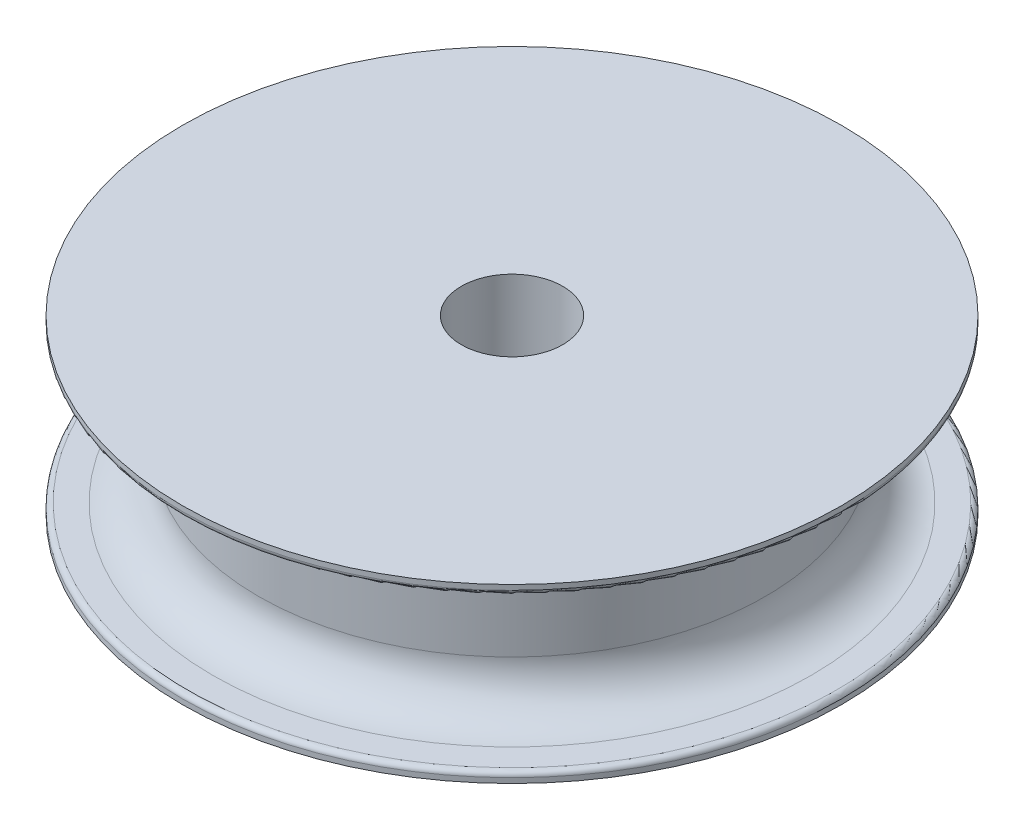
ISO-10303-21;
HEADER;
FILE_DESCRIPTION(('STEP AP214'),'2;1');
FILE_NAME('part.step','',(''),(''),'','','');
FILE_SCHEMA(('AUTOMOTIVE_DESIGN { 1 0 10303 214 1 1 1 1 }'));
ENDSEC;
DATA;
#1=APPLICATION_CONTEXT('core data for automotive mechanical design processes');
#2=APPLICATION_PROTOCOL_DEFINITION('international standard','automotive_design',2000,#1);
#3=PRODUCT_CONTEXT('',#1,'mechanical');
#4=PRODUCT('Part','Part','',(#3));
#5=PRODUCT_RELATED_PRODUCT_CATEGORY('part','',(#4));
#6=PRODUCT_DEFINITION_FORMATION('','',#4);
#7=PRODUCT_DEFINITION_CONTEXT('part definition',#1,'design');
#8=PRODUCT_DEFINITION('design','',#6,#7);
#9=PRODUCT_DEFINITION_SHAPE('','',#8);
#10=(LENGTH_UNIT() NAMED_UNIT(*) SI_UNIT(.MILLI.,.METRE.));
#11=(NAMED_UNIT(*) PLANE_ANGLE_UNIT() SI_UNIT($,.RADIAN.));
#12=(NAMED_UNIT(*) SI_UNIT($,.STERADIAN.) SOLID_ANGLE_UNIT());
#13=UNCERTAINTY_MEASURE_WITH_UNIT(LENGTH_MEASURE(1.E-05),#10,'distance_accuracy_value','');
#14=(GEOMETRIC_REPRESENTATION_CONTEXT(3) GLOBAL_UNCERTAINTY_ASSIGNED_CONTEXT((#13)) GLOBAL_UNIT_ASSIGNED_CONTEXT((#10,
#11,#12)) REPRESENTATION_CONTEXT('',''));
#15=CARTESIAN_POINT('',(0.,0.,0.));
#16=DIRECTION('',(0.,0.,1.));
#17=DIRECTION('',(1.,0.,0.));
#18=AXIS2_PLACEMENT_3D('',#15,#16,#17);
#19=CARTESIAN_POINT('',(0.,-15.,0.));
#20=DIRECTION('',(0.,1.,0.));
#21=DIRECTION('',(0.,0.,1.));
#22=AXIS2_PLACEMENT_3D('',#19,#20,#21);
#23=CYLINDRICAL_SURFACE('',#22,50.);
#24=CARTESIAN_POINT('',(0.,6.,0.));
#25=DIRECTION('',(0.,1.,0.));
#26=DIRECTION('',(0.,0.,1.));
#27=AXIS2_PLACEMENT_3D('',#24,#25,#26);
#28=CIRCLE('',#27,50.);
#29=CARTESIAN_POINT('',(0.,6.,50.));
#30=VERTEX_POINT('',#29);
#31=EDGE_CURVE('E10',#30,#30,#28,.F.);
#32=ORIENTED_EDGE('',*,*,#31,.T.);
#33=EDGE_LOOP('',(#32));
#34=FACE_BOUND('',#33,.T.);
#35=CARTESIAN_POINT('',(0.,-6.,0.));
#36=DIRECTION('',(0.,-1.,0.));
#37=DIRECTION('',(0.,0.,-1.));
#38=AXIS2_PLACEMENT_3D('',#35,#36,#37);
#39=CIRCLE('',#38,50.);
#40=CARTESIAN_POINT('',(0.,-6.,-50.));
#41=VERTEX_POINT('',#40);
#42=EDGE_CURVE('E60',#41,#41,#39,.F.);
#43=ORIENTED_EDGE('',*,*,#42,.T.);
#44=EDGE_LOOP('',(#43));
#45=FACE_BOUND('',#44,.T.);
#46=ADVANCED_FACE('F31',(#34,#45),#23,.T.);
#47=CARTESIAN_POINT('',(0.,-17.,0.));
#48=DIRECTION('',(0.,1.,0.));
#49=DIRECTION('',(0.,0.,1.));
#50=AXIS2_PLACEMENT_3D('',#47,#48,#49);
#51=CYLINDRICAL_SURFACE('',#50,65.);
#52=CARTESIAN_POINT('',(0.,-16.,0.));
#53=DIRECTION('',(0.,-1.,0.));
#54=DIRECTION('',(0.,0.,-1.));
#55=AXIS2_PLACEMENT_3D('',#52,#53,#54);
#56=CIRCLE('',#55,65.);
#57=CARTESIAN_POINT('',(0.,-16.,-65.));
#58=VERTEX_POINT('',#57);
#59=EDGE_CURVE('E54',#58,#58,#56,.T.);
#60=ORIENTED_EDGE('',*,*,#59,.T.);
#61=EDGE_LOOP('',(#60));
#62=FACE_BOUND('',#61,.T.);
#63=CARTESIAN_POINT('',(0.,-17.,0.));
#64=DIRECTION('',(0.,-1.,0.));
#65=DIRECTION('',(0.,0.,-1.));
#66=AXIS2_PLACEMENT_3D('',#63,#64,#65);
#67=CIRCLE('',#66,65.);
#68=CARTESIAN_POINT('',(0.,-17.,-65.));
#69=VERTEX_POINT('',#68);
#70=EDGE_CURVE('E63',#69,#69,#67,.T.);
#71=ORIENTED_EDGE('',*,*,#70,.F.);
#72=EDGE_LOOP('',(#71));
#73=FACE_BOUND('',#72,.T.);
#74=ADVANCED_FACE('F99',(#62,#73),#51,.T.);
#75=CARTESIAN_POINT('',(0.,-17.,0.));
#76=DIRECTION('',(0.,-1.,0.));
#77=DIRECTION('',(0.,0.,-1.));
#78=AXIS2_PLACEMENT_3D('',#75,#76,#77);
#79=PLANE('',#78);
#80=CARTESIAN_POINT('',(0.,-17.,0.));
#81=DIRECTION('',(0.,-1.,0.));
#82=DIRECTION('',(0.,0.,-1.));
#83=AXIS2_PLACEMENT_3D('',#80,#81,#82);
#84=CIRCLE('',#83,10.);
#85=CARTESIAN_POINT('',(0.,-17.,-10.));
#86=VERTEX_POINT('',#85);
#87=EDGE_CURVE('E70',#86,#86,#84,.F.);
#88=ORIENTED_EDGE('',*,*,#87,.T.);
#89=EDGE_LOOP('',(#88));
#90=FACE_BOUND('',#89,.T.);
#91=ORIENTED_EDGE('',*,*,#70,.T.);
#92=EDGE_LOOP('',(#91));
#93=FACE_BOUND('',#92,.T.);
#94=ADVANCED_FACE('F93',(#90,#93),#79,.T.);
#95=CARTESIAN_POINT('',(0.,-15.,0.));
#96=DIRECTION('',(0.,-1.,0.));
#97=DIRECTION('',(0.,0.,-1.));
#98=AXIS2_PLACEMENT_3D('',#95,#96,#97);
#99=PLANE('',#98);
#100=CARTESIAN_POINT('',(0.,-15.,0.));
#101=DIRECTION('',(0.,-1.,0.));
#102=DIRECTION('',(0.,0.,-1.));
#103=AXIS2_PLACEMENT_3D('',#100,#101,#102);
#104=CIRCLE('',#103,64.);
#105=CARTESIAN_POINT('',(0.,-15.,-64.));
#106=VERTEX_POINT('',#105);
#107=EDGE_CURVE('E51',#106,#106,#104,.F.);
#108=ORIENTED_EDGE('',*,*,#107,.T.);
#109=EDGE_LOOP('',(#108));
#110=FACE_BOUND('',#109,.T.);
#111=CARTESIAN_POINT('',(0.,-15.,0.));
#112=DIRECTION('',(0.,-1.,0.));
#113=DIRECTION('',(0.,0.,-1.));
#114=AXIS2_PLACEMENT_3D('',#111,#112,#113);
#115=CIRCLE('',#114,59.);
#116=CARTESIAN_POINT('',(0.,-15.,-59.));
#117=VERTEX_POINT('',#116);
#118=EDGE_CURVE('E57',#117,#117,#115,.T.);
#119=ORIENTED_EDGE('',*,*,#118,.T.);
#120=EDGE_LOOP('',(#119));
#121=FACE_BOUND('',#120,.T.);
#122=ADVANCED_FACE('F87',(#110,#121),#99,.F.);
#123=CARTESIAN_POINT('',(0.,17.,0.));
#124=DIRECTION('',(0.,-1.,0.));
#125=DIRECTION('',(0.,0.,-1.));
#126=AXIS2_PLACEMENT_3D('',#123,#124,#125);
#127=CYLINDRICAL_SURFACE('',#126,65.);
#128=CARTESIAN_POINT('',(0.,16.,0.));
#129=DIRECTION('',(0.,1.,0.));
#130=DIRECTION('',(0.,0.,1.));
#131=AXIS2_PLACEMENT_3D('',#128,#129,#130);
#132=CIRCLE('',#131,65.);
#133=CARTESIAN_POINT('',(0.,16.,65.));
#134=VERTEX_POINT('',#133);
#135=EDGE_CURVE('E46',#134,#134,#132,.T.);
#136=ORIENTED_EDGE('',*,*,#135,.T.);
#137=EDGE_LOOP('',(#136));
#138=FACE_BOUND('',#137,.T.);
#139=CARTESIAN_POINT('',(0.,17.,0.));
#140=DIRECTION('',(0.,1.,0.));
#141=DIRECTION('',(0.,0.,1.));
#142=AXIS2_PLACEMENT_3D('',#139,#140,#141);
#143=CIRCLE('',#142,65.);
#144=CARTESIAN_POINT('',(0.,17.,65.));
#145=VERTEX_POINT('',#144);
#146=EDGE_CURVE('E66',#145,#145,#143,.T.);
#147=ORIENTED_EDGE('',*,*,#146,.F.);
#148=EDGE_LOOP('',(#147));
#149=FACE_BOUND('',#148,.T.);
#150=ADVANCED_FACE('F82',(#138,#149),#127,.T.);
#151=CARTESIAN_POINT('',(0.,17.,0.));
#152=DIRECTION('',(0.,1.,0.));
#153=DIRECTION('',(0.,0.,1.));
#154=AXIS2_PLACEMENT_3D('',#151,#152,#153);
#155=PLANE('',#154);
#156=CARTESIAN_POINT('',(0.,17.,0.));
#157=DIRECTION('',(0.,1.,0.));
#158=DIRECTION('',(0.,0.,1.));
#159=AXIS2_PLACEMENT_3D('',#156,#157,#158);
#160=CIRCLE('',#159,10.);
#161=CARTESIAN_POINT('',(0.,17.,10.));
#162=VERTEX_POINT('',#161);
#163=EDGE_CURVE('E69',#162,#162,#160,.T.);
#164=ORIENTED_EDGE('',*,*,#163,.F.);
#165=EDGE_LOOP('',(#164));
#166=FACE_BOUND('',#165,.T.);
#167=ORIENTED_EDGE('',*,*,#146,.T.);
#168=EDGE_LOOP('',(#167));
#169=FACE_BOUND('',#168,.T.);
#170=ADVANCED_FACE('F78',(#166,#169),#155,.T.);
#171=CARTESIAN_POINT('',(0.,15.,0.));
#172=DIRECTION('',(0.,1.,0.));
#173=DIRECTION('',(0.,0.,1.));
#174=AXIS2_PLACEMENT_3D('',#171,#172,#173);
#175=PLANE('',#174);
#176=CARTESIAN_POINT('',(0.,15.,0.));
#177=DIRECTION('',(0.,1.,0.));
#178=DIRECTION('',(0.,0.,1.));
#179=AXIS2_PLACEMENT_3D('',#176,#177,#178);
#180=CIRCLE('',#179,59.);
#181=CARTESIAN_POINT('',(0.,15.,59.));
#182=VERTEX_POINT('',#181);
#183=EDGE_CURVE('E38',#182,#182,#180,.T.);
#184=ORIENTED_EDGE('',*,*,#183,.T.);
#185=EDGE_LOOP('',(#184));
#186=FACE_BOUND('',#185,.T.);
#187=CARTESIAN_POINT('',(0.,15.,0.));
#188=DIRECTION('',(0.,1.,0.));
#189=DIRECTION('',(0.,0.,1.));
#190=AXIS2_PLACEMENT_3D('',#187,#188,#189);
#191=CIRCLE('',#190,64.);
#192=CARTESIAN_POINT('',(0.,15.,64.));
#193=VERTEX_POINT('',#192);
#194=EDGE_CURVE('E42',#193,#193,#191,.F.);
#195=ORIENTED_EDGE('',*,*,#194,.T.);
#196=EDGE_LOOP('',(#195));
#197=FACE_BOUND('',#196,.T.);
#198=ADVANCED_FACE('F81',(#186,#197),#175,.F.);
#199=CARTESIAN_POINT('',(0.,-6.,0.));
#200=DIRECTION('',(0.,-1.,0.));
#201=DIRECTION('',(0.,0.,-1.));
#202=AXIS2_PLACEMENT_3D('',#199,#200,#201);
#203=TOROIDAL_SURFACE('',#202,59.,9.);
#204=ORIENTED_EDGE('',*,*,#118,.F.);
#205=EDGE_LOOP('',(#204));
#206=FACE_BOUND('',#205,.T.);
#207=ORIENTED_EDGE('',*,*,#42,.F.);
#208=EDGE_LOOP('',(#207));
#209=FACE_BOUND('',#208,.T.);
#210=ADVANCED_FACE('F108',(#206,#209),#203,.F.);
#211=CARTESIAN_POINT('',(0.,-16.,0.));
#212=DIRECTION('',(0.,-1.,0.));
#213=DIRECTION('',(0.,0.,-1.));
#214=AXIS2_PLACEMENT_3D('',#211,#212,#213);
#215=TOROIDAL_SURFACE('',#214,64.,1.);
#216=ORIENTED_EDGE('',*,*,#107,.F.);
#217=EDGE_LOOP('',(#216));
#218=FACE_BOUND('',#217,.T.);
#219=ORIENTED_EDGE('',*,*,#59,.F.);
#220=EDGE_LOOP('',(#219));
#221=FACE_BOUND('',#220,.T.);
#222=ADVANCED_FACE('F111',(#218,#221),#215,.T.);
#223=CARTESIAN_POINT('',(0.,16.,0.));
#224=DIRECTION('',(0.,1.,0.));
#225=DIRECTION('',(0.,0.,1.));
#226=AXIS2_PLACEMENT_3D('',#223,#224,#225);
#227=TOROIDAL_SURFACE('',#226,64.,1.);
#228=ORIENTED_EDGE('',*,*,#194,.F.);
#229=EDGE_LOOP('',(#228));
#230=FACE_BOUND('',#229,.T.);
#231=ORIENTED_EDGE('',*,*,#135,.F.);
#232=EDGE_LOOP('',(#231));
#233=FACE_BOUND('',#232,.T.);
#234=ADVANCED_FACE('F114',(#230,#233),#227,.T.);
#235=CARTESIAN_POINT('',(0.,6.,0.));
#236=DIRECTION('',(0.,1.,0.));
#237=DIRECTION('',(0.,0.,1.));
#238=AXIS2_PLACEMENT_3D('',#235,#236,#237);
#239=TOROIDAL_SURFACE('',#238,59.,9.);
#240=ORIENTED_EDGE('',*,*,#31,.F.);
#241=EDGE_LOOP('',(#240));
#242=FACE_BOUND('',#241,.T.);
#243=ORIENTED_EDGE('',*,*,#183,.F.);
#244=EDGE_LOOP('',(#243));
#245=FACE_BOUND('',#244,.T.);
#246=ADVANCED_FACE('F33',(#242,#245),#239,.F.);
#247=CARTESIAN_POINT('',(0.,-17.001,0.));
#248=DIRECTION('',(0.,1.,0.));
#249=DIRECTION('',(0.,0.,1.));
#250=AXIS2_PLACEMENT_3D('',#247,#248,#249);
#251=CYLINDRICAL_SURFACE('',#250,10.);
#252=ORIENTED_EDGE('',*,*,#87,.F.);
#253=EDGE_LOOP('',(#252));
#254=FACE_BOUND('',#253,.T.);
#255=ORIENTED_EDGE('',*,*,#163,.T.);
#256=EDGE_LOOP('',(#255));
#257=FACE_BOUND('',#256,.T.);
#258=ADVANCED_FACE('F76',(#254,#257),#251,.F.);
#259=CLOSED_SHELL('',(#46,#74,#94,#122,#150,#170,#198,#210,#222,#234,#246,#258));
#260=MANIFOLD_SOLID_BREP('B2',#259);
#261=ADVANCED_BREP_SHAPE_REPRESENTATION('',(#18,#260),#14);
#262=SHAPE_DEFINITION_REPRESENTATION(#9,#261);
ENDSEC;
END-ISO-10303-21;
